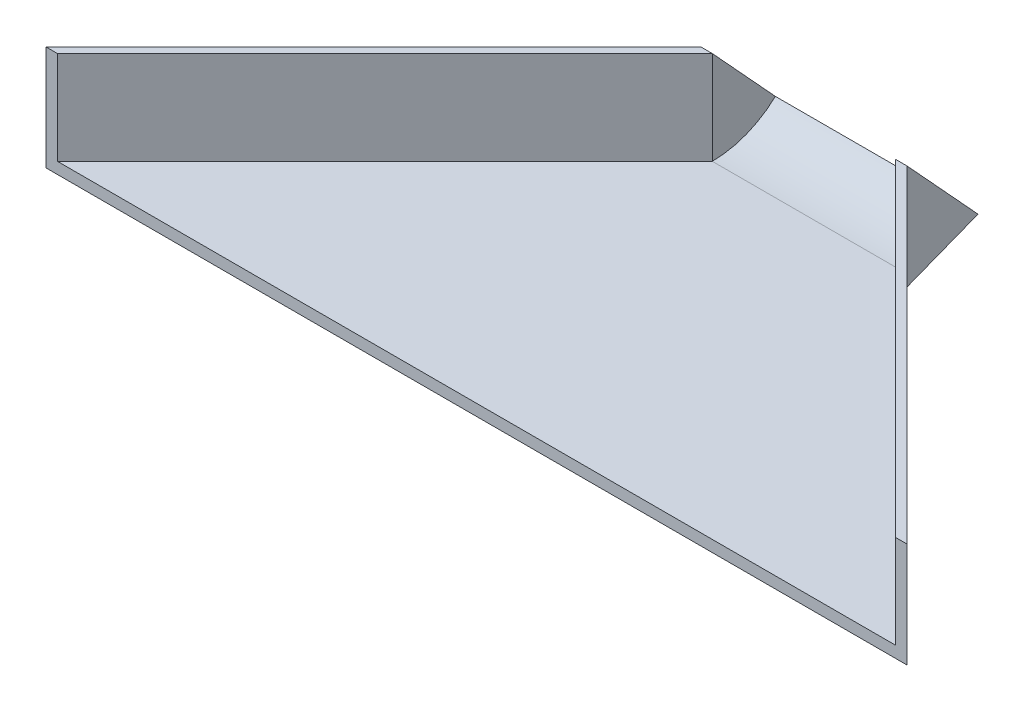
ISO-10303-21;
HEADER;
FILE_DESCRIPTION(('STEP AP214'),'2;1');
FILE_NAME('part.step','',(''),(''),'','','');
FILE_SCHEMA(('AUTOMOTIVE_DESIGN { 1 0 10303 214 1 1 1 1 }'));
ENDSEC;
DATA;
#1=APPLICATION_CONTEXT('core data for automotive mechanical design processes');
#2=APPLICATION_PROTOCOL_DEFINITION('international standard','automotive_design',2000,#1);
#3=PRODUCT_CONTEXT('',#1,'mechanical');
#4=PRODUCT('Part','Part','',(#3));
#5=PRODUCT_RELATED_PRODUCT_CATEGORY('part','',(#4));
#6=PRODUCT_DEFINITION_FORMATION('','',#4);
#7=PRODUCT_DEFINITION_CONTEXT('part definition',#1,'design');
#8=PRODUCT_DEFINITION('design','',#6,#7);
#9=PRODUCT_DEFINITION_SHAPE('','',#8);
#10=(LENGTH_UNIT() NAMED_UNIT(*) SI_UNIT(.MILLI.,.METRE.));
#11=(NAMED_UNIT(*) PLANE_ANGLE_UNIT() SI_UNIT($,.RADIAN.));
#12=(NAMED_UNIT(*) SI_UNIT($,.STERADIAN.) SOLID_ANGLE_UNIT());
#13=UNCERTAINTY_MEASURE_WITH_UNIT(LENGTH_MEASURE(1.E-05),#10,'distance_accuracy_value','');
#14=(GEOMETRIC_REPRESENTATION_CONTEXT(3) GLOBAL_UNCERTAINTY_ASSIGNED_CONTEXT((#13)) GLOBAL_UNIT_ASSIGNED_CONTEXT((#10,
#11,#12)) REPRESENTATION_CONTEXT('',''));
#15=CARTESIAN_POINT('',(0.,0.,0.));
#16=DIRECTION('',(0.,0.,1.));
#17=DIRECTION('',(1.,0.,0.));
#18=AXIS2_PLACEMENT_3D('',#15,#16,#17);
#19=CARTESIAN_POINT('',(44.45,25.4,-25.4));
#20=DIRECTION('',(1.,0.,0.));
#21=DIRECTION('',(0.,0.,-1.));
#22=AXIS2_PLACEMENT_3D('',#19,#20,#21);
#23=PLANE('',#22);
#24=CARTESIAN_POINT('',(44.45,25.3182080043655,0.));
#25=DIRECTION('',(1.,0.,0.));
#26=DIRECTION('',(0.,0.,-1.));
#27=AXIS2_PLACEMENT_3D('',#24,#25,#26);
#28=CIRCLE('',#27,22.5496080043655);
#29=CARTESIAN_POINT('',(44.45,2.7686,0.));
#30=VERTEX_POINT('',#29);
#31=CARTESIAN_POINT('',(44.45,8.75161916953628,-15.2981356879934));
#32=VERTEX_POINT('',#31);
#33=EDGE_CURVE('E142',#30,#32,#28,.T.);
#34=ORIENTED_EDGE('',*,*,#33,.F.);
#35=DIRECTION('',(0.,-1.,0.));
#36=VECTOR('',#35,1.);
#37=CARTESIAN_POINT('',(44.45,25.4,0.));
#38=LINE('',#37,#36);
#39=CARTESIAN_POINT('',(44.45,25.4,0.));
#40=VERTEX_POINT('',#39);
#41=EDGE_CURVE('E171',#40,#30,#38,.T.);
#42=ORIENTED_EDGE('',*,*,#41,.F.);
#43=DIRECTION('',(0.,0.736335815451119,0.676616262651095));
#44=VECTOR('',#43,1.);
#45=CARTESIAN_POINT('',(44.45,25.4,0.));
#46=LINE('',#45,#44);
#47=EDGE_CURVE('E157',#32,#40,#46,.T.);
#48=ORIENTED_EDGE('',*,*,#47,.F.);
#49=EDGE_LOOP('',(#34,#42,#48));
#50=FACE_BOUND('',#49,.T.);
#51=ADVANCED_FACE('F36',(#50),#23,.F.);
#52=CARTESIAN_POINT('',(0.,25.4,0.));
#53=DIRECTION('',(-0.707106781186546,0.,-0.707106781186548));
#54=DIRECTION('',(-0.707106781186549,0.,0.707106781186547));
#55=AXIS2_PLACEMENT_3D('',#52,#53,#54);
#56=PLANE('',#55);
#57=DIRECTION('',(0.,-1.,0.));
#58=VECTOR('',#57,1.);
#59=CARTESIAN_POINT('',(-79.3750000000003,25.4,79.375));
#60=LINE('',#59,#58);
#61=CARTESIAN_POINT('',(-79.3750000000003,25.4,79.375));
#62=VERTEX_POINT('',#61);
#63=CARTESIAN_POINT('',(-79.3750000000003,2.7686,79.375));
#64=VERTEX_POINT('',#63);
#65=EDGE_CURVE('E51',#62,#64,#60,.T.);
#66=ORIENTED_EDGE('',*,*,#65,.T.);
#67=DIRECTION('',(-0.707106781186549,0.,0.707106781186547));
#68=VECTOR('',#67,1.);
#69=CARTESIAN_POINT('',(0.,2.7686,0.));
#70=LINE('',#69,#68);
#71=CARTESIAN_POINT('',(1.04083408558608E-13,2.7686,0.));
#72=VERTEX_POINT('',#71);
#73=EDGE_CURVE('E185',#72,#64,#70,.T.);
#74=ORIENTED_EDGE('',*,*,#73,.F.);
#75=DIRECTION('',(0.,-1.,0.));
#76=VECTOR('',#75,1.);
#77=CARTESIAN_POINT('',(0.,25.4,0.));
#78=LINE('',#77,#76);
#79=CARTESIAN_POINT('',(0.,25.4,0.));
#80=VERTEX_POINT('',#79);
#81=EDGE_CURVE('E11',#80,#72,#78,.T.);
#82=ORIENTED_EDGE('',*,*,#81,.F.);
#83=DIRECTION('',(0.707106781186549,0.,-0.707106781186546));
#84=VECTOR('',#83,1.);
#85=CARTESIAN_POINT('',(0.,25.4,0.));
#86=LINE('',#85,#84);
#87=EDGE_CURVE('E79',#62,#80,#86,.T.);
#88=ORIENTED_EDGE('',*,*,#87,.F.);
#89=EDGE_LOOP('',(#66,#74,#82,#88));
#90=FACE_BOUND('',#89,.T.);
#91=ADVANCED_FACE('F38',(#90),#56,.F.);
#92=CARTESIAN_POINT('',(-1.38429999999999,25.4,-1.38429999999999));
#93=DIRECTION('',(0.707106781186547,0.,0.707106781186548));
#94=DIRECTION('',(0.707106781186548,0.,-0.707106781186547));
#95=AXIS2_PLACEMENT_3D('',#92,#93,#94);
#96=PLANE('',#95);
#97=DIRECTION('',(-0.707106781186548,0.,0.707106781186547));
#98=VECTOR('',#97,1.);
#99=CARTESIAN_POINT('',(-1.38429999999999,0.,-1.38429999999999));
#100=LINE('',#99,#98);
#101=CARTESIAN_POINT('',(-2.76859999999999,0.,0.));
#102=VERTEX_POINT('',#101);
#103=CARTESIAN_POINT('',(-82.1436000000002,0.,79.375));
#104=VERTEX_POINT('',#103);
#105=EDGE_CURVE('E75',#102,#104,#100,.T.);
#106=ORIENTED_EDGE('',*,*,#105,.T.);
#107=DIRECTION('',(0.,-1.,0.));
#108=VECTOR('',#107,1.);
#109=CARTESIAN_POINT('',(-82.1436000000002,25.4,79.375));
#110=LINE('',#109,#108);
#111=CARTESIAN_POINT('',(-82.1436000000002,25.4,79.375));
#112=VERTEX_POINT('',#111);
#113=EDGE_CURVE('E207',#112,#104,#110,.T.);
#114=ORIENTED_EDGE('',*,*,#113,.F.);
#115=DIRECTION('',(-0.707106781186548,0.,0.707106781186547));
#116=VECTOR('',#115,1.);
#117=CARTESIAN_POINT('',(-1.38429999999999,25.4,-1.38429999999999));
#118=LINE('',#117,#116);
#119=CARTESIAN_POINT('',(-2.76859999999999,25.4,0.));
#120=VERTEX_POINT('',#119);
#121=EDGE_CURVE('E200',#120,#112,#118,.T.);
#122=ORIENTED_EDGE('',*,*,#121,.F.);
#123=DIRECTION('',(0.,-1.,0.));
#124=VECTOR('',#123,1.);
#125=CARTESIAN_POINT('',(-2.76859999999999,25.4,0.));
#126=LINE('',#125,#124);
#127=EDGE_CURVE('E44',#120,#102,#126,.T.);
#128=ORIENTED_EDGE('',*,*,#127,.T.);
#129=EDGE_LOOP('',(#106,#114,#122,#128));
#130=FACE_BOUND('',#129,.T.);
#131=ADVANCED_FACE('F209',(#130),#96,.F.);
#132=CARTESIAN_POINT('',(0.,25.4,79.375));
#133=DIRECTION('',(0.,0.,-1.));
#134=DIRECTION('',(-1.,0.,0.));
#135=AXIS2_PLACEMENT_3D('',#132,#133,#134);
#136=PLANE('',#135);
#137=DIRECTION('',(1.,0.,0.));
#138=VECTOR('',#137,1.);
#139=CARTESIAN_POINT('',(0.,0.,79.375));
#140=LINE('',#139,#138);
#141=CARTESIAN_POINT('',(126.5936,0.,79.375));
#142=VERTEX_POINT('',#141);
#143=EDGE_CURVE('E198',#104,#142,#140,.T.);
#144=ORIENTED_EDGE('',*,*,#143,.T.);
#145=DIRECTION('',(0.,-1.,0.));
#146=VECTOR('',#145,1.);
#147=CARTESIAN_POINT('',(126.5936,25.4,79.375));
#148=LINE('',#147,#146);
#149=CARTESIAN_POINT('',(126.5936,25.4,79.375));
#150=VERTEX_POINT('',#149);
#151=EDGE_CURVE('E179',#150,#142,#148,.T.);
#152=ORIENTED_EDGE('',*,*,#151,.F.);
#153=DIRECTION('',(1.,0.,0.));
#154=VECTOR('',#153,1.);
#155=CARTESIAN_POINT('',(0.,25.4,79.375));
#156=LINE('',#155,#154);
#157=CARTESIAN_POINT('',(123.825,25.4,79.375));
#158=VERTEX_POINT('',#157);
#159=EDGE_CURVE('E166',#158,#150,#156,.T.);
#160=ORIENTED_EDGE('',*,*,#159,.F.);
#161=DIRECTION('',(0.,-1.,0.));
#162=VECTOR('',#161,1.);
#163=CARTESIAN_POINT('',(123.825,25.4,79.375));
#164=LINE('',#163,#162);
#165=CARTESIAN_POINT('',(123.825,2.7686,79.375));
#166=VERTEX_POINT('',#165);
#167=EDGE_CURVE('E182',#158,#166,#164,.T.);
#168=ORIENTED_EDGE('',*,*,#167,.T.);
#169=DIRECTION('',(1.,0.,0.));
#170=VECTOR('',#169,1.);
#171=CARTESIAN_POINT('',(-79.3750000000003,2.7686,79.375));
#172=LINE('',#171,#170);
#173=EDGE_CURVE('E188',#64,#166,#172,.T.);
#174=ORIENTED_EDGE('',*,*,#173,.F.);
#175=ORIENTED_EDGE('',*,*,#65,.F.);
#176=DIRECTION('',(1.,0.,0.));
#177=VECTOR('',#176,1.);
#178=CARTESIAN_POINT('',(0.,25.4,79.375));
#179=LINE('',#178,#177);
#180=EDGE_CURVE('E60',#112,#62,#179,.T.);
#181=ORIENTED_EDGE('',*,*,#180,.F.);
#182=ORIENTED_EDGE('',*,*,#113,.T.);
#183=EDGE_LOOP('',(#144,#152,#160,#168,#174,#175,#181,#182));
#184=FACE_BOUND('',#183,.T.);
#185=ADVANCED_FACE('F216',(#184),#136,.F.);
#186=CARTESIAN_POINT('',(0.,25.4,0.));
#187=DIRECTION('',(0.,1.,0.));
#188=DIRECTION('',(0.,0.,1.));
#189=AXIS2_PLACEMENT_3D('',#186,#187,#188);
#190=PLANE('',#189);
#191=ORIENTED_EDGE('',*,*,#87,.T.);
#192=DIRECTION('',(-1.,0.,0.));
#193=VECTOR('',#192,1.);
#194=CARTESIAN_POINT('',(0.,25.4,0.));
#195=LINE('',#194,#193);
#196=EDGE_CURVE('E197',#80,#120,#195,.T.);
#197=ORIENTED_EDGE('',*,*,#196,.T.);
#198=ORIENTED_EDGE('',*,*,#121,.T.);
#199=ORIENTED_EDGE('',*,*,#180,.T.);
#200=EDGE_LOOP('',(#191,#197,#198,#199));
#201=FACE_BOUND('',#200,.T.);
#202=ADVANCED_FACE('F260',(#201),#190,.T.);
#203=CARTESIAN_POINT('',(0.,0.,0.));
#204=DIRECTION('',(0.,1.,0.));
#205=DIRECTION('',(0.,0.,1.));
#206=AXIS2_PLACEMENT_3D('',#203,#204,#205);
#207=PLANE('',#206);
#208=DIRECTION('',(-1.,0.,0.));
#209=VECTOR('',#208,1.);
#210=CARTESIAN_POINT('',(0.,0.,0.));
#211=LINE('',#210,#209);
#212=CARTESIAN_POINT('',(47.2186,0.,0.));
#213=VERTEX_POINT('',#212);
#214=EDGE_CURVE('E140',#213,#102,#211,.T.);
#215=ORIENTED_EDGE('',*,*,#214,.F.);
#216=DIRECTION('',(-0.707106781186546,0.,-0.707106781186549));
#217=VECTOR('',#216,1.);
#218=CARTESIAN_POINT('',(23.6093000000001,0.,-23.6093));
#219=LINE('',#218,#217);
#220=EDGE_CURVE('E159',#142,#213,#219,.T.);
#221=ORIENTED_EDGE('',*,*,#220,.F.);
#222=ORIENTED_EDGE('',*,*,#143,.F.);
#223=ORIENTED_EDGE('',*,*,#105,.F.);
#224=EDGE_LOOP('',(#215,#221,#222,#223));
#225=FACE_BOUND('',#224,.T.);
#226=ADVANCED_FACE('F212',(#225),#207,.F.);
#227=CARTESIAN_POINT('',(0.,2.7686,0.));
#228=DIRECTION('',(0.,1.,0.));
#229=DIRECTION('',(0.,0.,1.));
#230=AXIS2_PLACEMENT_3D('',#227,#228,#229);
#231=PLANE('',#230);
#232=ORIENTED_EDGE('',*,*,#73,.T.);
#233=ORIENTED_EDGE('',*,*,#173,.T.);
#234=DIRECTION('',(-0.707106781186546,0.,-0.707106781186549));
#235=VECTOR('',#234,1.);
#236=CARTESIAN_POINT('',(44.45,2.7686,0.));
#237=LINE('',#236,#235);
#238=EDGE_CURVE('E190',#166,#30,#237,.T.);
#239=ORIENTED_EDGE('',*,*,#238,.T.);
#240=DIRECTION('',(-1.,0.,0.));
#241=VECTOR('',#240,1.);
#242=CARTESIAN_POINT('',(0.,2.7686,0.));
#243=LINE('',#242,#241);
#244=EDGE_CURVE('E193',#30,#72,#243,.T.);
#245=ORIENTED_EDGE('',*,*,#244,.T.);
#246=EDGE_LOOP('',(#232,#233,#239,#245));
#247=FACE_BOUND('',#246,.T.);
#248=ADVANCED_FACE('F231',(#247),#231,.T.);
#249=CARTESIAN_POINT('',(22.2250000000001,25.4,-22.225));
#250=DIRECTION('',(0.707106781186549,0.,-0.707106781186546));
#251=DIRECTION('',(-0.707106781186546,0.,-0.707106781186549));
#252=AXIS2_PLACEMENT_3D('',#249,#250,#251);
#253=PLANE('',#252);
#254=ORIENTED_EDGE('',*,*,#238,.F.);
#255=ORIENTED_EDGE('',*,*,#167,.F.);
#256=DIRECTION('',(0.707106781186546,0.,0.707106781186549));
#257=VECTOR('',#256,1.);
#258=CARTESIAN_POINT('',(22.2250000000001,25.4,-22.225));
#259=LINE('',#258,#257);
#260=EDGE_CURVE('E163',#40,#158,#259,.T.);
#261=ORIENTED_EDGE('',*,*,#260,.F.);
#262=ORIENTED_EDGE('',*,*,#41,.T.);
#263=EDGE_LOOP('',(#254,#255,#261,#262));
#264=FACE_BOUND('',#263,.T.);
#265=ADVANCED_FACE('F229',(#264),#253,.F.);
#266=CARTESIAN_POINT('',(23.6093000000001,25.4,-23.6093));
#267=DIRECTION('',(-0.707106781186549,0.,0.707106781186546));
#268=DIRECTION('',(0.707106781186546,0.,0.707106781186549));
#269=AXIS2_PLACEMENT_3D('',#266,#267,#268);
#270=PLANE('',#269);
#271=ORIENTED_EDGE('',*,*,#220,.T.);
#272=DIRECTION('',(0.,-1.,0.));
#273=VECTOR('',#272,1.);
#274=CARTESIAN_POINT('',(47.2186,25.4,0.));
#275=LINE('',#274,#273);
#276=CARTESIAN_POINT('',(47.2186,25.4,0.));
#277=VERTEX_POINT('',#276);
#278=EDGE_CURVE('E176',#277,#213,#275,.T.);
#279=ORIENTED_EDGE('',*,*,#278,.F.);
#280=DIRECTION('',(-0.707106781186546,0.,-0.707106781186549));
#281=VECTOR('',#280,1.);
#282=CARTESIAN_POINT('',(23.6093000000001,25.4,-23.6093));
#283=LINE('',#282,#281);
#284=EDGE_CURVE('E168',#150,#277,#283,.T.);
#285=ORIENTED_EDGE('',*,*,#284,.F.);
#286=ORIENTED_EDGE('',*,*,#151,.T.);
#287=EDGE_LOOP('',(#271,#279,#285,#286));
#288=FACE_BOUND('',#287,.T.);
#289=ADVANCED_FACE('F219',(#288),#270,.F.);
#290=CARTESIAN_POINT('',(0.,25.4,0.));
#291=DIRECTION('',(0.,1.,0.));
#292=DIRECTION('',(0.,0.,1.));
#293=AXIS2_PLACEMENT_3D('',#290,#291,#292);
#294=PLANE('',#293);
#295=DIRECTION('',(1.,0.,0.));
#296=VECTOR('',#295,1.);
#297=CARTESIAN_POINT('',(8.52897551572338,25.4,0.));
#298=LINE('',#297,#296);
#299=EDGE_CURVE('E134',#40,#277,#298,.T.);
#300=ORIENTED_EDGE('',*,*,#299,.F.);
#301=ORIENTED_EDGE('',*,*,#260,.T.);
#302=ORIENTED_EDGE('',*,*,#159,.T.);
#303=ORIENTED_EDGE('',*,*,#284,.T.);
#304=EDGE_LOOP('',(#300,#301,#302,#303));
#305=FACE_BOUND('',#304,.T.);
#306=ADVANCED_FACE('F223',(#305),#294,.T.);
#307=CARTESIAN_POINT('',(47.2186,0.,-25.4));
#308=DIRECTION('',(-1.,0.,0.));
#309=DIRECTION('',(0.,0.,1.));
#310=AXIS2_PLACEMENT_3D('',#307,#308,#309);
#311=PLANE('',#310);
#312=DIRECTION('',(0.,-0.36308811489704,0.931754807243039));
#313=VECTOR('',#312,1.);
#314=CARTESIAN_POINT('',(47.2186,6.6970893940882,-17.1860355144027));
#315=LINE('',#314,#313);
#316=CARTESIAN_POINT('',(47.2186,6.6970893940882,-17.1860355144027));
#317=VERTEX_POINT('',#316);
#318=EDGE_CURVE('E135',#317,#213,#315,.T.);
#319=ORIENTED_EDGE('',*,*,#318,.F.);
#320=DIRECTION('',(0.,-0.736335815451119,-0.676616262651095));
#321=VECTOR('',#320,1.);
#322=CARTESIAN_POINT('',(47.2186,25.4,0.));
#323=LINE('',#322,#321);
#324=EDGE_CURVE('E130',#277,#317,#323,.T.);
#325=ORIENTED_EDGE('',*,*,#324,.F.);
#326=ORIENTED_EDGE('',*,*,#278,.T.);
#327=EDGE_LOOP('',(#319,#325,#326));
#328=FACE_BOUND('',#327,.T.);
#329=ADVANCED_FACE('F248',(#328),#311,.F.);
#330=CARTESIAN_POINT('',(8.52897551572338,25.4,0.));
#331=DIRECTION('',(0.,-0.676616262651095,0.736335815451119));
#332=DIRECTION('',(0.,-0.736335815451119,-0.676616262651095));
#333=AXIS2_PLACEMENT_3D('',#330,#331,#332);
#334=PLANE('',#333);
#335=DIRECTION('',(1.,0.,0.));
#336=VECTOR('',#335,1.);
#337=CARTESIAN_POINT('',(8.52897551572338,6.6970893940882,-17.1860355144027));
#338=LINE('',#337,#336);
#339=CARTESIAN_POINT('',(-2.76859999999989,6.6970893940882,-17.1860355144027));
#340=VERTEX_POINT('',#339);
#341=EDGE_CURVE('E122',#340,#317,#338,.T.);
#342=ORIENTED_EDGE('',*,*,#341,.F.);
#343=DIRECTION('',(0.,-0.736335815451119,-0.676616262651095));
#344=VECTOR('',#343,1.);
#345=CARTESIAN_POINT('',(-2.76859999999989,25.4,0.));
#346=LINE('',#345,#344);
#347=EDGE_CURVE('E127',#120,#340,#346,.T.);
#348=ORIENTED_EDGE('',*,*,#347,.F.);
#349=ORIENTED_EDGE('',*,*,#196,.F.);
#350=DIRECTION('',(0.,-0.736335815451119,-0.676616262651095));
#351=VECTOR('',#350,1.);
#352=CARTESIAN_POINT('',(0.,25.4,0.));
#353=LINE('',#352,#351);
#354=CARTESIAN_POINT('',(1.11022302462516E-13,8.75161916953628,-15.2981356879934));
#355=VERTEX_POINT('',#354);
#356=EDGE_CURVE('E145',#80,#355,#353,.T.);
#357=ORIENTED_EDGE('',*,*,#356,.T.);
#358=DIRECTION('',(1.,0.,0.));
#359=VECTOR('',#358,1.);
#360=CARTESIAN_POINT('',(-19.2860222646066,8.75161916953628,-15.2981356879934));
#361=LINE('',#360,#359);
#362=EDGE_CURVE('E152',#355,#32,#361,.T.);
#363=ORIENTED_EDGE('',*,*,#362,.T.);
#364=ORIENTED_EDGE('',*,*,#47,.T.);
#365=ORIENTED_EDGE('',*,*,#299,.T.);
#366=ORIENTED_EDGE('',*,*,#324,.T.);
#367=EDGE_LOOP('',(#342,#348,#349,#357,#363,#364,#365,#366));
#368=FACE_BOUND('',#367,.T.);
#369=ADVANCED_FACE('F124',(#368),#334,.F.);
#370=CARTESIAN_POINT('',(8.52897551572338,6.6970893940882,-17.1860355144027));
#371=DIRECTION('',(0.,0.931754807243039,0.36308811489704));
#372=DIRECTION('',(0.,-0.363088114897041,0.93175480724304));
#373=AXIS2_PLACEMENT_3D('',#370,#371,#372);
#374=PLANE('',#373);
#375=ORIENTED_EDGE('',*,*,#318,.T.);
#376=ORIENTED_EDGE('',*,*,#214,.T.);
#377=DIRECTION('',(0.,-0.36308811489704,0.93175480724304));
#378=VECTOR('',#377,1.);
#379=CARTESIAN_POINT('',(-2.76859999999989,6.6970893940882,-17.1860355144027));
#380=LINE('',#379,#378);
#381=EDGE_CURVE('E138',#340,#102,#380,.T.);
#382=ORIENTED_EDGE('',*,*,#381,.F.);
#383=ORIENTED_EDGE('',*,*,#341,.T.);
#384=EDGE_LOOP('',(#375,#376,#382,#383));
#385=FACE_BOUND('',#384,.T.);
#386=ADVANCED_FACE('F139',(#385),#374,.F.);
#387=CARTESIAN_POINT('',(-19.2860222646066,25.3182080043655,0.));
#388=DIRECTION('',(1.,0.,0.));
#389=DIRECTION('',(0.,0.,-1.));
#390=AXIS2_PLACEMENT_3D('',#387,#388,#389);
#391=CYLINDRICAL_SURFACE('',#390,22.5496080043655);
#392=CARTESIAN_POINT('',(1.07552855510562E-13,25.3182080043655,0.));
#393=DIRECTION('',(-1.,0.,0.));
#394=DIRECTION('',(0.,0.,1.));
#395=AXIS2_PLACEMENT_3D('',#392,#393,#394);
#396=CIRCLE('',#395,22.5496080043655);
#397=EDGE_CURVE('E153',#72,#355,#396,.F.);
#398=ORIENTED_EDGE('',*,*,#397,.F.);
#399=ORIENTED_EDGE('',*,*,#244,.F.);
#400=ORIENTED_EDGE('',*,*,#33,.T.);
#401=ORIENTED_EDGE('',*,*,#362,.F.);
#402=EDGE_LOOP('',(#398,#399,#400,#401));
#403=FACE_BOUND('',#402,.T.);
#404=ADVANCED_FACE('F236',(#403),#391,.F.);
#405=CARTESIAN_POINT('',(0.,0.,0.));
#406=DIRECTION('',(1.,0.,0.));
#407=DIRECTION('',(0.,0.,-1.));
#408=AXIS2_PLACEMENT_3D('',#405,#406,#407);
#409=PLANE('',#408);
#410=ORIENTED_EDGE('',*,*,#397,.T.);
#411=ORIENTED_EDGE('',*,*,#356,.F.);
#412=ORIENTED_EDGE('',*,*,#81,.T.);
#413=EDGE_LOOP('',(#410,#411,#412));
#414=FACE_BOUND('',#413,.T.);
#415=ADVANCED_FACE('F234',(#414),#409,.T.);
#416=CARTESIAN_POINT('',(-2.76859999999985,162.13000535669,-167.567911534632));
#417=DIRECTION('',(-1.,0.,0.));
#418=DIRECTION('',(0.,-0.676616262651094,0.73633581545112));
#419=AXIS2_PLACEMENT_3D('',#416,#417,#418);
#420=PLANE('',#419);
#421=ORIENTED_EDGE('',*,*,#347,.T.);
#422=ORIENTED_EDGE('',*,*,#381,.T.);
#423=ORIENTED_EDGE('',*,*,#127,.F.);
#424=EDGE_LOOP('',(#421,#422,#423));
#425=FACE_BOUND('',#424,.T.);
#426=ADVANCED_FACE('F144',(#425),#420,.T.);
#427=CLOSED_SHELL('',(#51,#91,#131,#185,#202,#226,#248,#265,#289,#306,#329,#369,#386,#404,#415,#426));
#428=MANIFOLD_SOLID_BREP('B2',#427);
#429=ADVANCED_BREP_SHAPE_REPRESENTATION('',(#18,#428),#14);
#430=SHAPE_DEFINITION_REPRESENTATION(#9,#429);
ENDSEC;
END-ISO-10303-21;
